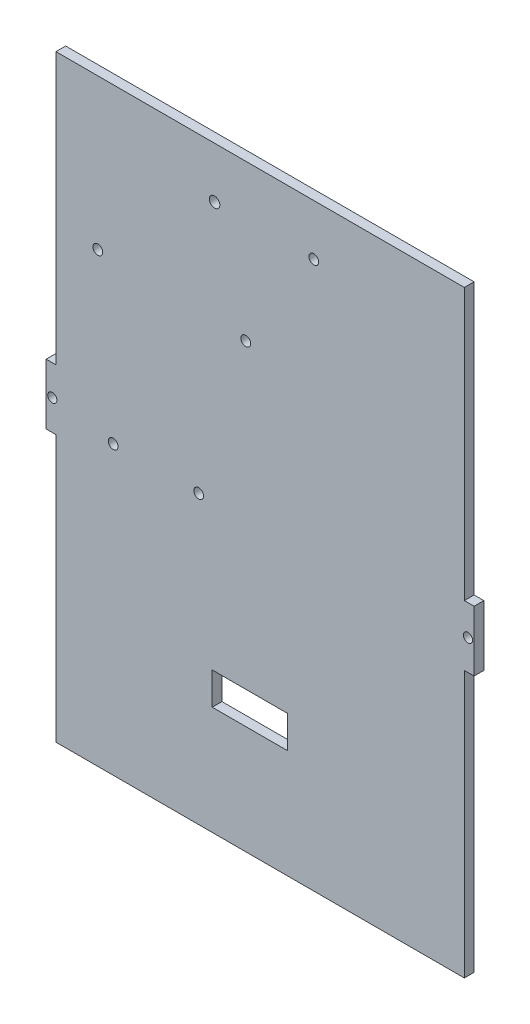
ISO-10303-21;
HEADER;
FILE_DESCRIPTION(('STEP AP214'),'2;1');
FILE_NAME('part.step','',(''),(''),'','','');
FILE_SCHEMA(('AUTOMOTIVE_DESIGN { 1 0 10303 214 1 1 1 1 }'));
ENDSEC;
DATA;
#1=APPLICATION_CONTEXT('core data for automotive mechanical design processes');
#2=APPLICATION_PROTOCOL_DEFINITION('international standard','automotive_design',2000,#1);
#3=PRODUCT_CONTEXT('',#1,'mechanical');
#4=PRODUCT('Part','Part','',(#3));
#5=PRODUCT_RELATED_PRODUCT_CATEGORY('part','',(#4));
#6=PRODUCT_DEFINITION_FORMATION('','',#4);
#7=PRODUCT_DEFINITION_CONTEXT('part definition',#1,'design');
#8=PRODUCT_DEFINITION('design','',#6,#7);
#9=PRODUCT_DEFINITION_SHAPE('','',#8);
#10=(LENGTH_UNIT() NAMED_UNIT(*) SI_UNIT(.MILLI.,.METRE.));
#11=(NAMED_UNIT(*) PLANE_ANGLE_UNIT() SI_UNIT($,.RADIAN.));
#12=(NAMED_UNIT(*) SI_UNIT($,.STERADIAN.) SOLID_ANGLE_UNIT());
#13=UNCERTAINTY_MEASURE_WITH_UNIT(LENGTH_MEASURE(1.E-05),#10,'distance_accuracy_value','');
#14=(GEOMETRIC_REPRESENTATION_CONTEXT(3) GLOBAL_UNCERTAINTY_ASSIGNED_CONTEXT((#13)) GLOBAL_UNIT_ASSIGNED_CONTEXT((#10,
#11,#12)) REPRESENTATION_CONTEXT('',''));
#15=CARTESIAN_POINT('',(0.,0.,0.));
#16=DIRECTION('',(0.,0.,1.));
#17=DIRECTION('',(1.,0.,0.));
#18=AXIS2_PLACEMENT_3D('',#15,#16,#17);
#19=CARTESIAN_POINT('',(69.85,100.01,3.18));
#20=DIRECTION('',(-1.,0.,0.));
#21=DIRECTION('',(0.,-1.,0.));
#22=AXIS2_PLACEMENT_3D('',#19,#20,#21);
#23=PLANE('',#22);
#24=DIRECTION('',(0.,1.,0.));
#25=VECTOR('',#24,1.);
#26=CARTESIAN_POINT('',(69.85,100.01,0.));
#27=LINE('',#26,#25);
#28=CARTESIAN_POINT('',(69.85,-9.875,0.));
#29=VERTEX_POINT('',#28);
#30=CARTESIAN_POINT('',(69.85,9.875,0.));
#31=VERTEX_POINT('',#30);
#32=EDGE_CURVE('E285',#29,#31,#27,.T.);
#33=ORIENTED_EDGE('',*,*,#32,.T.);
#34=DIRECTION('',(0.,0.,1.));
#35=VECTOR('',#34,1.);
#36=CARTESIAN_POINT('',(69.85,9.875,0.));
#37=LINE('',#36,#35);
#38=CARTESIAN_POINT('',(69.85,9.875,3.18));
#39=VERTEX_POINT('',#38);
#40=EDGE_CURVE('E308',#31,#39,#37,.T.);
#41=ORIENTED_EDGE('',*,*,#40,.T.);
#42=DIRECTION('',(0.,1.,0.));
#43=VECTOR('',#42,1.);
#44=CARTESIAN_POINT('',(69.85,100.01,3.18));
#45=LINE('',#44,#43);
#46=CARTESIAN_POINT('',(69.85,-9.875,3.18));
#47=VERTEX_POINT('',#46);
#48=EDGE_CURVE('E57',#47,#39,#45,.T.);
#49=ORIENTED_EDGE('',*,*,#48,.F.);
#50=DIRECTION('',(0.,0.,1.));
#51=VECTOR('',#50,1.);
#52=CARTESIAN_POINT('',(69.85,-9.875,0.));
#53=LINE('',#52,#51);
#54=EDGE_CURVE('E294',#29,#47,#53,.T.);
#55=ORIENTED_EDGE('',*,*,#54,.F.);
#56=EDGE_LOOP('',(#33,#41,#49,#55));
#57=FACE_BOUND('',#56,.T.);
#58=ADVANCED_FACE('F49',(#57),#23,.F.);
#59=CARTESIAN_POINT('',(-69.85,100.01,3.18));
#60=DIRECTION('',(1.,0.,0.));
#61=DIRECTION('',(0.,1.,0.));
#62=AXIS2_PLACEMENT_3D('',#59,#60,#61);
#63=PLANE('',#62);
#64=DIRECTION('',(0.,-1.,0.));
#65=VECTOR('',#64,1.);
#66=CARTESIAN_POINT('',(-69.85,100.01,3.18));
#67=LINE('',#66,#65);
#68=CARTESIAN_POINT('',(-69.85,9.875,3.18));
#69=VERTEX_POINT('',#68);
#70=CARTESIAN_POINT('',(-69.85,-9.875,3.18));
#71=VERTEX_POINT('',#70);
#72=EDGE_CURVE('E13',#69,#71,#67,.T.);
#73=ORIENTED_EDGE('',*,*,#72,.F.);
#74=DIRECTION('',(0.,0.,1.));
#75=VECTOR('',#74,1.);
#76=CARTESIAN_POINT('',(-69.85,9.875,0.));
#77=LINE('',#76,#75);
#78=CARTESIAN_POINT('',(-69.85,9.875,0.));
#79=VERTEX_POINT('',#78);
#80=EDGE_CURVE('E278',#79,#69,#77,.T.);
#81=ORIENTED_EDGE('',*,*,#80,.F.);
#82=DIRECTION('',(0.,-1.,0.));
#83=VECTOR('',#82,1.);
#84=CARTESIAN_POINT('',(-69.85,100.01,0.));
#85=LINE('',#84,#83);
#86=CARTESIAN_POINT('',(-69.85,-9.875,0.));
#87=VERTEX_POINT('',#86);
#88=EDGE_CURVE('E323',#79,#87,#85,.T.);
#89=ORIENTED_EDGE('',*,*,#88,.T.);
#90=DIRECTION('',(0.,0.,1.));
#91=VECTOR('',#90,1.);
#92=CARTESIAN_POINT('',(-69.85,-9.875,0.));
#93=LINE('',#92,#91);
#94=EDGE_CURVE('E259',#87,#71,#93,.T.);
#95=ORIENTED_EDGE('',*,*,#94,.T.);
#96=EDGE_LOOP('',(#73,#81,#89,#95));
#97=FACE_BOUND('',#96,.T.);
#98=ADVANCED_FACE('F346',(#97),#63,.F.);
#99=CARTESIAN_POINT('',(0.,0.,3.18));
#100=DIRECTION('',(0.,0.,1.));
#101=DIRECTION('',(1.,0.,0.));
#102=AXIS2_PLACEMENT_3D('',#99,#100,#101);
#103=PLANE('',#102);
#104=DIRECTION('',(-1.,0.,0.));
#105=VECTOR('',#104,1.);
#106=CARTESIAN_POINT('',(-66.67,-96.83,3.18));
#107=LINE('',#106,#105);
#108=CARTESIAN_POINT('',(66.67,-96.83,3.18));
#109=VERTEX_POINT('',#108);
#110=CARTESIAN_POINT('',(-66.67,-96.83,3.18));
#111=VERTEX_POINT('',#110);
#112=EDGE_CURVE('E241',#109,#111,#107,.T.);
#113=ORIENTED_EDGE('',*,*,#112,.F.);
#114=DIRECTION('',(0.,-1.,0.));
#115=VECTOR('',#114,1.);
#116=CARTESIAN_POINT('',(66.67,-100.01,3.18));
#117=LINE('',#116,#115);
#118=CARTESIAN_POINT('',(66.67,-9.87499999999999,3.18));
#119=VERTEX_POINT('',#118);
#120=EDGE_CURVE('E291',#119,#109,#117,.T.);
#121=ORIENTED_EDGE('',*,*,#120,.F.);
#122=DIRECTION('',(-1.,0.,0.));
#123=VECTOR('',#122,1.);
#124=CARTESIAN_POINT('',(69.85,-9.875,3.18));
#125=LINE('',#124,#123);
#126=EDGE_CURVE('E295',#47,#119,#125,.T.);
#127=ORIENTED_EDGE('',*,*,#126,.F.);
#128=ORIENTED_EDGE('',*,*,#48,.T.);
#129=DIRECTION('',(1.,0.,0.));
#130=VECTOR('',#129,1.);
#131=CARTESIAN_POINT('',(69.85,9.875,3.18));
#132=LINE('',#131,#130);
#133=CARTESIAN_POINT('',(66.67,9.875,3.18));
#134=VERTEX_POINT('',#133);
#135=EDGE_CURVE('E312',#134,#39,#132,.T.);
#136=ORIENTED_EDGE('',*,*,#135,.F.);
#137=DIRECTION('',(0.,-1.,0.));
#138=VECTOR('',#137,1.);
#139=CARTESIAN_POINT('',(66.67,100.01,3.18));
#140=LINE('',#139,#138);
#141=CARTESIAN_POINT('',(66.67,98.4200000000002,3.18));
#142=VERTEX_POINT('',#141);
#143=EDGE_CURVE('E245',#142,#134,#140,.T.);
#144=ORIENTED_EDGE('',*,*,#143,.F.);
#145=DIRECTION('',(1.,0.,0.));
#146=VECTOR('',#145,1.);
#147=CARTESIAN_POINT('',(66.67,98.4200000000002,3.18));
#148=LINE('',#147,#146);
#149=CARTESIAN_POINT('',(-66.67,98.4200000000002,3.18));
#150=VERTEX_POINT('',#149);
#151=EDGE_CURVE('E206',#150,#142,#148,.T.);
#152=ORIENTED_EDGE('',*,*,#151,.F.);
#153=DIRECTION('',(0.,1.,0.));
#154=VECTOR('',#153,1.);
#155=CARTESIAN_POINT('',(-66.67,100.01,3.18));
#156=LINE('',#155,#154);
#157=CARTESIAN_POINT('',(-66.67,9.875,3.18));
#158=VERTEX_POINT('',#157);
#159=EDGE_CURVE('E275',#158,#150,#156,.T.);
#160=ORIENTED_EDGE('',*,*,#159,.F.);
#161=DIRECTION('',(1.,0.,0.));
#162=VECTOR('',#161,1.);
#163=CARTESIAN_POINT('',(-69.85,9.875,3.18));
#164=LINE('',#163,#162);
#165=EDGE_CURVE('E262',#69,#158,#164,.T.);
#166=ORIENTED_EDGE('',*,*,#165,.F.);
#167=ORIENTED_EDGE('',*,*,#72,.T.);
#168=DIRECTION('',(-1.,0.,0.));
#169=VECTOR('',#168,1.);
#170=CARTESIAN_POINT('',(-69.85,-9.875,3.18));
#171=LINE('',#170,#169);
#172=CARTESIAN_POINT('',(-66.67,-9.87499999999999,3.18));
#173=VERTEX_POINT('',#172);
#174=EDGE_CURVE('E251',#173,#71,#171,.T.);
#175=ORIENTED_EDGE('',*,*,#174,.F.);
#176=DIRECTION('',(0.,1.,0.));
#177=VECTOR('',#176,1.);
#178=CARTESIAN_POINT('',(-66.67,-100.01,3.18));
#179=LINE('',#178,#177);
#180=EDGE_CURVE('E255',#111,#173,#179,.T.);
#181=ORIENTED_EDGE('',*,*,#180,.F.);
#182=EDGE_LOOP('',(#113,#121,#127,#128,#136,#144,#152,#160,#166,#167,#175,#181));
#183=FACE_BOUND('',#182,.T.);
#184=CARTESIAN_POINT('',(17.5238782385584,81.7973984042533,3.18));
#185=DIRECTION('',(0.,0.,1.));
#186=DIRECTION('',(1.,0.,0.));
#187=AXIS2_PLACEMENT_3D('',#184,#185,#186);
#188=CIRCLE('',#187,1.59000000000001);
#189=CARTESIAN_POINT('',(19.1138782385584,81.7973984042533,3.18));
#190=VERTEX_POINT('',#189);
#191=EDGE_CURVE('E330',#190,#190,#188,.T.);
#192=ORIENTED_EDGE('',*,*,#191,.F.);
#193=EDGE_LOOP('',(#192));
#194=FACE_BOUND('',#193,.T.);
#195=CARTESIAN_POINT('',(-14.8830919482617,81.7973984042533,3.18));
#196=DIRECTION('',(0.,0.,1.));
#197=DIRECTION('',(1.,0.,0.));
#198=AXIS2_PLACEMENT_3D('',#195,#196,#197);
#199=CIRCLE('',#198,1.71788268037511);
#200=CARTESIAN_POINT('',(-13.1652092678866,81.7973984042533,3.18));
#201=VERTEX_POINT('',#200);
#202=EDGE_CURVE('E187',#201,#201,#199,.T.);
#203=ORIENTED_EDGE('',*,*,#202,.F.);
#204=EDGE_LOOP('',(#203));
#205=FACE_BOUND('',#204,.T.);
#206=DIRECTION('',(0.,1.,0.));
#207=VECTOR('',#206,1.);
#208=CARTESIAN_POINT('',(8.92310875962821,-61.418139549545,3.18));
#209=LINE('',#208,#207);
#210=CARTESIAN_POINT('',(8.92310875962821,-61.418139549545,3.18));
#211=VERTEX_POINT('',#210);
#212=CARTESIAN_POINT('',(8.92310875962821,-50.8809258858847,3.18));
#213=VERTEX_POINT('',#212);
#214=EDGE_CURVE('E65',#211,#213,#209,.T.);
#215=ORIENTED_EDGE('',*,*,#214,.F.);
#216=DIRECTION('',(1.,0.,0.));
#217=VECTOR('',#216,1.);
#218=CARTESIAN_POINT('',(8.92310875962821,-61.418139549545,3.18));
#219=LINE('',#218,#217);
#220=CARTESIAN_POINT('',(-15.6426883360048,-61.418139549545,3.18));
#221=VERTEX_POINT('',#220);
#222=EDGE_CURVE('E181',#221,#211,#219,.T.);
#223=ORIENTED_EDGE('',*,*,#222,.F.);
#224=DIRECTION('',(0.,-1.,0.));
#225=VECTOR('',#224,1.);
#226=CARTESIAN_POINT('',(-15.6426883360048,-61.418139549545,3.18));
#227=LINE('',#226,#225);
#228=CARTESIAN_POINT('',(-15.6426883360048,-50.8809258858847,3.18));
#229=VERTEX_POINT('',#228);
#230=EDGE_CURVE('E184',#229,#221,#227,.T.);
#231=ORIENTED_EDGE('',*,*,#230,.F.);
#232=DIRECTION('',(-1.,0.,0.));
#233=VECTOR('',#232,1.);
#234=CARTESIAN_POINT('',(8.92310875962821,-50.8809258858847,3.18));
#235=LINE('',#234,#233);
#236=EDGE_CURVE('E193',#213,#229,#235,.T.);
#237=ORIENTED_EDGE('',*,*,#236,.F.);
#238=EDGE_LOOP('',(#215,#223,#231,#237));
#239=FACE_BOUND('',#238,.T.);
#240=CARTESIAN_POINT('',(-52.9812612776326,49.2928561322299,3.18));
#241=DIRECTION('',(0.,0.,1.));
#242=DIRECTION('',(1.,0.,0.));
#243=AXIS2_PLACEMENT_3D('',#240,#241,#242);
#244=CIRCLE('',#243,1.60000000000001);
#245=CARTESIAN_POINT('',(-51.3812612776326,49.2928561322299,3.18));
#246=VERTEX_POINT('',#245);
#247=EDGE_CURVE('E207',#246,#246,#244,.T.);
#248=ORIENTED_EDGE('',*,*,#247,.F.);
#249=EDGE_LOOP('',(#248));
#250=FACE_BOUND('',#249,.T.);
#251=CARTESIAN_POINT('',(-4.68387739000854,47.6157426562039,3.18));
#252=DIRECTION('',(0.,0.,1.));
#253=DIRECTION('',(1.,0.,0.));
#254=AXIS2_PLACEMENT_3D('',#251,#252,#253);
#255=CIRCLE('',#254,1.6);
#256=CARTESIAN_POINT('',(-3.08387739000854,47.6157426562039,3.18));
#257=VERTEX_POINT('',#256);
#258=EDGE_CURVE('E213',#257,#257,#255,.T.);
#259=ORIENTED_EDGE('',*,*,#258,.F.);
#260=EDGE_LOOP('',(#259));
#261=FACE_BOUND('',#260,.T.);
#262=CARTESIAN_POINT('',(-20.0649648908923,-3.15976470010088,3.18));
#263=DIRECTION('',(0.,0.,1.));
#264=DIRECTION('',(1.,0.,0.));
#265=AXIS2_PLACEMENT_3D('',#262,#263,#264);
#266=CIRCLE('',#265,1.6);
#267=CARTESIAN_POINT('',(-18.4649648908923,-3.15976470010088,3.18));
#268=VERTEX_POINT('',#267);
#269=EDGE_CURVE('E219',#268,#268,#266,.T.);
#270=ORIENTED_EDGE('',*,*,#269,.F.);
#271=EDGE_LOOP('',(#270));
#272=FACE_BOUND('',#271,.T.);
#273=CARTESIAN_POINT('',(-47.9649293307285,-3.1152197129914,3.18));
#274=DIRECTION('',(0.,0.,1.));
#275=DIRECTION('',(1.,0.,0.));
#276=AXIS2_PLACEMENT_3D('',#273,#274,#275);
#277=CIRCLE('',#276,1.6);
#278=CARTESIAN_POINT('',(-46.3649293307285,-3.1152197129914,3.18));
#279=VERTEX_POINT('',#278);
#280=EDGE_CURVE('E199',#279,#279,#277,.T.);
#281=ORIENTED_EDGE('',*,*,#280,.F.);
#282=EDGE_LOOP('',(#281));
#283=FACE_BOUND('',#282,.T.);
#284=CARTESIAN_POINT('',(67.85,0.,3.18));
#285=DIRECTION('',(0.,0.,1.));
#286=DIRECTION('',(-1.,0.,0.));
#287=AXIS2_PLACEMENT_3D('',#284,#285,#286);
#288=CIRCLE('',#287,1.5);
#289=CARTESIAN_POINT('',(66.35,0.,3.18));
#290=VERTEX_POINT('',#289);
#291=EDGE_CURVE('E305',#290,#290,#288,.T.);
#292=ORIENTED_EDGE('',*,*,#291,.F.);
#293=EDGE_LOOP('',(#292));
#294=FACE_BOUND('',#293,.T.);
#295=CARTESIAN_POINT('',(-67.85,0.,3.18));
#296=DIRECTION('',(0.,0.,1.));
#297=DIRECTION('',(1.,0.,0.));
#298=AXIS2_PLACEMENT_3D('',#295,#296,#297);
#299=CIRCLE('',#298,1.5);
#300=CARTESIAN_POINT('',(-66.35,0.,3.18));
#301=VERTEX_POINT('',#300);
#302=EDGE_CURVE('E267',#301,#301,#299,.T.);
#303=ORIENTED_EDGE('',*,*,#302,.F.);
#304=EDGE_LOOP('',(#303));
#305=FACE_BOUND('',#304,.T.);
#306=ADVANCED_FACE('F343',(#183,#194,#205,#239,#250,#261,#272,#283,#294,#305),#103,.T.);
#307=CARTESIAN_POINT('',(0.,0.,0.));
#308=DIRECTION('',(0.,0.,1.));
#309=DIRECTION('',(1.,0.,0.));
#310=AXIS2_PLACEMENT_3D('',#307,#308,#309);
#311=PLANE('',#310);
#312=CARTESIAN_POINT('',(17.5238782385584,81.7973984042533,0.));
#313=DIRECTION('',(0.,0.,1.));
#314=DIRECTION('',(1.,0.,0.));
#315=AXIS2_PLACEMENT_3D('',#312,#313,#314);
#316=CIRCLE('',#315,1.59000000000001);
#317=CARTESIAN_POINT('',(19.1138782385584,81.7973984042533,0.));
#318=VERTEX_POINT('',#317);
#319=EDGE_CURVE('E52',#318,#318,#316,.T.);
#320=ORIENTED_EDGE('',*,*,#319,.T.);
#321=EDGE_LOOP('',(#320));
#322=FACE_BOUND('',#321,.T.);
#323=CARTESIAN_POINT('',(-14.8830919482617,81.7973984042533,0.));
#324=DIRECTION('',(0.,0.,1.));
#325=DIRECTION('',(1.,0.,0.));
#326=AXIS2_PLACEMENT_3D('',#323,#324,#325);
#327=CIRCLE('',#326,1.71788268037511);
#328=CARTESIAN_POINT('',(-13.1652092678866,81.7973984042533,0.));
#329=VERTEX_POINT('',#328);
#330=EDGE_CURVE('E328',#329,#329,#327,.T.);
#331=ORIENTED_EDGE('',*,*,#330,.T.);
#332=EDGE_LOOP('',(#331));
#333=FACE_BOUND('',#332,.T.);
#334=DIRECTION('',(1.,0.,0.));
#335=VECTOR('',#334,1.);
#336=CARTESIAN_POINT('',(8.92310875962821,-61.418139549545,0.));
#337=LINE('',#336,#335);
#338=CARTESIAN_POINT('',(-15.6426883360048,-61.418139549545,0.));
#339=VERTEX_POINT('',#338);
#340=CARTESIAN_POINT('',(8.92310875962821,-61.418139549545,0.));
#341=VERTEX_POINT('',#340);
#342=EDGE_CURVE('E171',#339,#341,#337,.T.);
#343=ORIENTED_EDGE('',*,*,#342,.T.);
#344=DIRECTION('',(0.,1.,0.));
#345=VECTOR('',#344,1.);
#346=CARTESIAN_POINT('',(8.92310875962821,-61.418139549545,0.));
#347=LINE('',#346,#345);
#348=CARTESIAN_POINT('',(8.92310875962821,-50.8809258858847,0.));
#349=VERTEX_POINT('',#348);
#350=EDGE_CURVE('E165',#341,#349,#347,.T.);
#351=ORIENTED_EDGE('',*,*,#350,.T.);
#352=DIRECTION('',(-1.,0.,0.));
#353=VECTOR('',#352,1.);
#354=CARTESIAN_POINT('',(8.92310875962821,-50.8809258858847,0.));
#355=LINE('',#354,#353);
#356=CARTESIAN_POINT('',(-15.6426883360048,-50.8809258858847,0.));
#357=VERTEX_POINT('',#356);
#358=EDGE_CURVE('E174',#349,#357,#355,.T.);
#359=ORIENTED_EDGE('',*,*,#358,.T.);
#360=DIRECTION('',(0.,-1.,0.));
#361=VECTOR('',#360,1.);
#362=CARTESIAN_POINT('',(-15.6426883360048,-61.418139549545,0.));
#363=LINE('',#362,#361);
#364=EDGE_CURVE('E73',#357,#339,#363,.T.);
#365=ORIENTED_EDGE('',*,*,#364,.T.);
#366=EDGE_LOOP('',(#343,#351,#359,#365));
#367=FACE_BOUND('',#366,.T.);
#368=CARTESIAN_POINT('',(-52.9812612776326,49.2928561322299,0.));
#369=DIRECTION('',(0.,0.,1.));
#370=DIRECTION('',(1.,0.,0.));
#371=AXIS2_PLACEMENT_3D('',#368,#369,#370);
#372=CIRCLE('',#371,1.60000000000001);
#373=CARTESIAN_POINT('',(-51.3812612776326,49.2928561322299,0.));
#374=VERTEX_POINT('',#373);
#375=EDGE_CURVE('E203',#374,#374,#372,.T.);
#376=ORIENTED_EDGE('',*,*,#375,.T.);
#377=EDGE_LOOP('',(#376));
#378=FACE_BOUND('',#377,.T.);
#379=CARTESIAN_POINT('',(-4.68387739000854,47.6157426562039,0.));
#380=DIRECTION('',(0.,0.,1.));
#381=DIRECTION('',(1.,0.,0.));
#382=AXIS2_PLACEMENT_3D('',#379,#380,#381);
#383=CIRCLE('',#382,1.6);
#384=CARTESIAN_POINT('',(-3.08387739000854,47.6157426562039,0.));
#385=VERTEX_POINT('',#384);
#386=EDGE_CURVE('E210',#385,#385,#383,.T.);
#387=ORIENTED_EDGE('',*,*,#386,.T.);
#388=EDGE_LOOP('',(#387));
#389=FACE_BOUND('',#388,.T.);
#390=CARTESIAN_POINT('',(-20.0649648908923,-3.15976470010088,0.));
#391=DIRECTION('',(0.,0.,1.));
#392=DIRECTION('',(1.,0.,0.));
#393=AXIS2_PLACEMENT_3D('',#390,#391,#392);
#394=CIRCLE('',#393,1.6);
#395=CARTESIAN_POINT('',(-18.4649648908923,-3.15976470010088,0.));
#396=VERTEX_POINT('',#395);
#397=EDGE_CURVE('E216',#396,#396,#394,.T.);
#398=ORIENTED_EDGE('',*,*,#397,.T.);
#399=EDGE_LOOP('',(#398));
#400=FACE_BOUND('',#399,.T.);
#401=CARTESIAN_POINT('',(-47.9649293307285,-3.1152197129914,0.));
#402=DIRECTION('',(0.,0.,1.));
#403=DIRECTION('',(1.,0.,0.));
#404=AXIS2_PLACEMENT_3D('',#401,#402,#403);
#405=CIRCLE('',#404,1.6);
#406=CARTESIAN_POINT('',(-46.3649293307285,-3.1152197129914,0.));
#407=VERTEX_POINT('',#406);
#408=EDGE_CURVE('E222',#407,#407,#405,.T.);
#409=ORIENTED_EDGE('',*,*,#408,.T.);
#410=EDGE_LOOP('',(#409));
#411=FACE_BOUND('',#410,.T.);
#412=DIRECTION('',(0.,-1.,0.));
#413=VECTOR('',#412,1.);
#414=CARTESIAN_POINT('',(66.67,-100.01,0.));
#415=LINE('',#414,#413);
#416=CARTESIAN_POINT('',(66.67,-9.87499999999999,0.));
#417=VERTEX_POINT('',#416);
#418=CARTESIAN_POINT('',(66.67,-96.83,0.));
#419=VERTEX_POINT('',#418);
#420=EDGE_CURVE('E290',#417,#419,#415,.T.);
#421=ORIENTED_EDGE('',*,*,#420,.T.);
#422=DIRECTION('',(-1.,0.,0.));
#423=VECTOR('',#422,1.);
#424=CARTESIAN_POINT('',(-66.67,-96.83,0.));
#425=LINE('',#424,#423);
#426=CARTESIAN_POINT('',(-66.67,-96.83,0.));
#427=VERTEX_POINT('',#426);
#428=EDGE_CURVE('E237',#419,#427,#425,.T.);
#429=ORIENTED_EDGE('',*,*,#428,.T.);
#430=DIRECTION('',(0.,1.,0.));
#431=VECTOR('',#430,1.);
#432=CARTESIAN_POINT('',(-66.67,-100.01,0.));
#433=LINE('',#432,#431);
#434=CARTESIAN_POINT('',(-66.67,-9.87499999999999,0.));
#435=VERTEX_POINT('',#434);
#436=EDGE_CURVE('E248',#427,#435,#433,.T.);
#437=ORIENTED_EDGE('',*,*,#436,.T.);
#438=DIRECTION('',(-1.,0.,0.));
#439=VECTOR('',#438,1.);
#440=CARTESIAN_POINT('',(-69.85,-9.875,0.));
#441=LINE('',#440,#439);
#442=EDGE_CURVE('E250',#435,#87,#441,.T.);
#443=ORIENTED_EDGE('',*,*,#442,.T.);
#444=ORIENTED_EDGE('',*,*,#88,.F.);
#445=DIRECTION('',(1.,0.,0.));
#446=VECTOR('',#445,1.);
#447=CARTESIAN_POINT('',(-69.85,9.875,0.));
#448=LINE('',#447,#446);
#449=CARTESIAN_POINT('',(-66.67,9.875,0.));
#450=VERTEX_POINT('',#449);
#451=EDGE_CURVE('E271',#79,#450,#448,.T.);
#452=ORIENTED_EDGE('',*,*,#451,.T.);
#453=DIRECTION('',(0.,1.,0.));
#454=VECTOR('',#453,1.);
#455=CARTESIAN_POINT('',(-66.67,100.01,0.));
#456=LINE('',#455,#454);
#457=CARTESIAN_POINT('',(-66.67,98.4200000000002,0.));
#458=VERTEX_POINT('',#457);
#459=EDGE_CURVE('E274',#450,#458,#456,.T.);
#460=ORIENTED_EDGE('',*,*,#459,.T.);
#461=DIRECTION('',(1.,0.,0.));
#462=VECTOR('',#461,1.);
#463=CARTESIAN_POINT('',(66.67,98.4200000000002,0.));
#464=LINE('',#463,#462);
#465=CARTESIAN_POINT('',(66.67,98.4200000000002,0.));
#466=VERTEX_POINT('',#465);
#467=EDGE_CURVE('E227',#458,#466,#464,.T.);
#468=ORIENTED_EDGE('',*,*,#467,.T.);
#469=DIRECTION('',(0.,-1.,0.));
#470=VECTOR('',#469,1.);
#471=CARTESIAN_POINT('',(66.67,100.01,0.));
#472=LINE('',#471,#470);
#473=CARTESIAN_POINT('',(66.67,9.875,0.));
#474=VERTEX_POINT('',#473);
#475=EDGE_CURVE('E309',#466,#474,#472,.T.);
#476=ORIENTED_EDGE('',*,*,#475,.T.);
#477=DIRECTION('',(1.,0.,0.));
#478=VECTOR('',#477,1.);
#479=CARTESIAN_POINT('',(69.85,9.875,0.));
#480=LINE('',#479,#478);
#481=EDGE_CURVE('E311',#474,#31,#480,.T.);
#482=ORIENTED_EDGE('',*,*,#481,.T.);
#483=ORIENTED_EDGE('',*,*,#32,.F.);
#484=DIRECTION('',(-1.,0.,0.));
#485=VECTOR('',#484,1.);
#486=CARTESIAN_POINT('',(69.85,-9.875,0.));
#487=LINE('',#486,#485);
#488=EDGE_CURVE('E287',#29,#417,#487,.T.);
#489=ORIENTED_EDGE('',*,*,#488,.T.);
#490=EDGE_LOOP('',(#421,#429,#437,#443,#444,#452,#460,#468,#476,#482,#483,#489));
#491=FACE_BOUND('',#490,.T.);
#492=CARTESIAN_POINT('',(67.85,0.,0.));
#493=DIRECTION('',(0.,0.,1.));
#494=DIRECTION('',(-1.,0.,0.));
#495=AXIS2_PLACEMENT_3D('',#492,#493,#494);
#496=CIRCLE('',#495,1.5);
#497=CARTESIAN_POINT('',(66.35,0.,0.));
#498=VERTEX_POINT('',#497);
#499=EDGE_CURVE('E298',#498,#498,#496,.T.);
#500=ORIENTED_EDGE('',*,*,#499,.T.);
#501=EDGE_LOOP('',(#500));
#502=FACE_BOUND('',#501,.T.);
#503=CARTESIAN_POINT('',(-67.85,0.,0.));
#504=DIRECTION('',(0.,0.,1.));
#505=DIRECTION('',(1.,0.,0.));
#506=AXIS2_PLACEMENT_3D('',#503,#504,#505);
#507=CIRCLE('',#506,1.5);
#508=CARTESIAN_POINT('',(-66.35,0.,0.));
#509=VERTEX_POINT('',#508);
#510=EDGE_CURVE('E257',#509,#509,#507,.T.);
#511=ORIENTED_EDGE('',*,*,#510,.T.);
#512=EDGE_LOOP('',(#511));
#513=FACE_BOUND('',#512,.T.);
#514=ADVANCED_FACE('F178',(#322,#333,#367,#378,#389,#400,#411,#491,#502,#513),#311,.F.);
#515=CARTESIAN_POINT('',(-67.85,0.,0.));
#516=DIRECTION('',(0.,0.,1.));
#517=DIRECTION('',(1.,0.,0.));
#518=AXIS2_PLACEMENT_3D('',#515,#516,#517);
#519=CYLINDRICAL_SURFACE('',#518,1.5);
#520=ORIENTED_EDGE('',*,*,#510,.F.);
#521=EDGE_LOOP('',(#520));
#522=FACE_BOUND('',#521,.T.);
#523=ORIENTED_EDGE('',*,*,#302,.T.);
#524=EDGE_LOOP('',(#523));
#525=FACE_BOUND('',#524,.T.);
#526=ADVANCED_FACE('F363',(#522,#525),#519,.F.);
#527=CARTESIAN_POINT('',(-69.85,-9.875,0.));
#528=DIRECTION('',(0.,1.,0.));
#529=DIRECTION('',(-1.,0.,0.));
#530=AXIS2_PLACEMENT_3D('',#527,#528,#529);
#531=PLANE('',#530);
#532=ORIENTED_EDGE('',*,*,#174,.T.);
#533=ORIENTED_EDGE('',*,*,#94,.F.);
#534=ORIENTED_EDGE('',*,*,#442,.F.);
#535=DIRECTION('',(0.,0.,1.));
#536=VECTOR('',#535,1.);
#537=CARTESIAN_POINT('',(-66.67,-9.87499999999999,0.));
#538=LINE('',#537,#536);
#539=EDGE_CURVE('E254',#435,#173,#538,.T.);
#540=ORIENTED_EDGE('',*,*,#539,.T.);
#541=EDGE_LOOP('',(#532,#533,#534,#540));
#542=FACE_BOUND('',#541,.T.);
#543=ADVANCED_FACE('F365',(#542),#531,.F.);
#544=CARTESIAN_POINT('',(-66.67,-100.01,0.));
#545=DIRECTION('',(1.,0.,0.));
#546=DIRECTION('',(0.,1.,0.));
#547=AXIS2_PLACEMENT_3D('',#544,#545,#546);
#548=PLANE('',#547);
#549=ORIENTED_EDGE('',*,*,#436,.F.);
#550=DIRECTION('',(0.,0.,1.));
#551=VECTOR('',#550,1.);
#552=CARTESIAN_POINT('',(-66.67,-96.83,0.));
#553=LINE('',#552,#551);
#554=EDGE_CURVE('E240',#427,#111,#553,.T.);
#555=ORIENTED_EDGE('',*,*,#554,.T.);
#556=ORIENTED_EDGE('',*,*,#180,.T.);
#557=ORIENTED_EDGE('',*,*,#539,.F.);
#558=EDGE_LOOP('',(#549,#555,#556,#557));
#559=FACE_BOUND('',#558,.T.);
#560=ADVANCED_FACE('F372',(#559),#548,.F.);
#561=CARTESIAN_POINT('',(-66.67,100.01,0.));
#562=DIRECTION('',(1.,0.,0.));
#563=DIRECTION('',(0.,1.,0.));
#564=AXIS2_PLACEMENT_3D('',#561,#562,#563);
#565=PLANE('',#564);
#566=ORIENTED_EDGE('',*,*,#159,.T.);
#567=DIRECTION('',(0.,0.,1.));
#568=VECTOR('',#567,1.);
#569=CARTESIAN_POINT('',(-66.67,98.4200000000002,0.));
#570=LINE('',#569,#568);
#571=EDGE_CURVE('E230',#458,#150,#570,.T.);
#572=ORIENTED_EDGE('',*,*,#571,.F.);
#573=ORIENTED_EDGE('',*,*,#459,.F.);
#574=DIRECTION('',(0.,0.,1.));
#575=VECTOR('',#574,1.);
#576=CARTESIAN_POINT('',(-66.67,9.875,0.));
#577=LINE('',#576,#575);
#578=EDGE_CURVE('E283',#450,#158,#577,.T.);
#579=ORIENTED_EDGE('',*,*,#578,.T.);
#580=EDGE_LOOP('',(#566,#572,#573,#579));
#581=FACE_BOUND('',#580,.T.);
#582=ADVANCED_FACE('F426',(#581),#565,.F.);
#583=CARTESIAN_POINT('',(-69.85,9.875,0.));
#584=DIRECTION('',(0.,-1.,0.));
#585=DIRECTION('',(1.,0.,0.));
#586=AXIS2_PLACEMENT_3D('',#583,#584,#585);
#587=PLANE('',#586);
#588=ORIENTED_EDGE('',*,*,#165,.T.);
#589=ORIENTED_EDGE('',*,*,#578,.F.);
#590=ORIENTED_EDGE('',*,*,#451,.F.);
#591=ORIENTED_EDGE('',*,*,#80,.T.);
#592=EDGE_LOOP('',(#588,#589,#590,#591));
#593=FACE_BOUND('',#592,.T.);
#594=ADVANCED_FACE('F424',(#593),#587,.F.);
#595=CARTESIAN_POINT('',(66.67,-100.01,0.));
#596=DIRECTION('',(-1.,0.,0.));
#597=DIRECTION('',(0.,-1.,0.));
#598=AXIS2_PLACEMENT_3D('',#595,#596,#597);
#599=PLANE('',#598);
#600=ORIENTED_EDGE('',*,*,#120,.T.);
#601=DIRECTION('',(0.,0.,1.));
#602=VECTOR('',#601,1.);
#603=CARTESIAN_POINT('',(66.67,-96.83,0.));
#604=LINE('',#603,#602);
#605=EDGE_CURVE('E235',#419,#109,#604,.T.);
#606=ORIENTED_EDGE('',*,*,#605,.F.);
#607=ORIENTED_EDGE('',*,*,#420,.F.);
#608=DIRECTION('',(0.,0.,1.));
#609=VECTOR('',#608,1.);
#610=CARTESIAN_POINT('',(66.67,-9.87499999999999,0.));
#611=LINE('',#610,#609);
#612=EDGE_CURVE('E270',#417,#119,#611,.T.);
#613=ORIENTED_EDGE('',*,*,#612,.T.);
#614=EDGE_LOOP('',(#600,#606,#607,#613));
#615=FACE_BOUND('',#614,.T.);
#616=ADVANCED_FACE('F409',(#615),#599,.F.);
#617=CARTESIAN_POINT('',(69.85,-9.875,0.));
#618=DIRECTION('',(0.,1.,0.));
#619=DIRECTION('',(-1.,0.,0.));
#620=AXIS2_PLACEMENT_3D('',#617,#618,#619);
#621=PLANE('',#620);
#622=ORIENTED_EDGE('',*,*,#126,.T.);
#623=ORIENTED_EDGE('',*,*,#612,.F.);
#624=ORIENTED_EDGE('',*,*,#488,.F.);
#625=ORIENTED_EDGE('',*,*,#54,.T.);
#626=EDGE_LOOP('',(#622,#623,#624,#625));
#627=FACE_BOUND('',#626,.T.);
#628=ADVANCED_FACE('F407',(#627),#621,.F.);
#629=CARTESIAN_POINT('',(67.85,0.,0.));
#630=DIRECTION('',(0.,0.,1.));
#631=DIRECTION('',(1.,0.,0.));
#632=AXIS2_PLACEMENT_3D('',#629,#630,#631);
#633=CYLINDRICAL_SURFACE('',#632,1.5);
#634=ORIENTED_EDGE('',*,*,#499,.F.);
#635=EDGE_LOOP('',(#634));
#636=FACE_BOUND('',#635,.T.);
#637=ORIENTED_EDGE('',*,*,#291,.T.);
#638=EDGE_LOOP('',(#637));
#639=FACE_BOUND('',#638,.T.);
#640=ADVANCED_FACE('F456',(#636,#639),#633,.F.);
#641=CARTESIAN_POINT('',(69.85,9.875,0.));
#642=DIRECTION('',(0.,-1.,0.));
#643=DIRECTION('',(1.,0.,0.));
#644=AXIS2_PLACEMENT_3D('',#641,#642,#643);
#645=PLANE('',#644);
#646=ORIENTED_EDGE('',*,*,#135,.T.);
#647=ORIENTED_EDGE('',*,*,#40,.F.);
#648=ORIENTED_EDGE('',*,*,#481,.F.);
#649=DIRECTION('',(0.,0.,1.));
#650=VECTOR('',#649,1.);
#651=CARTESIAN_POINT('',(66.67,9.875,0.));
#652=LINE('',#651,#650);
#653=EDGE_CURVE('E315',#474,#134,#652,.T.);
#654=ORIENTED_EDGE('',*,*,#653,.T.);
#655=EDGE_LOOP('',(#646,#647,#648,#654));
#656=FACE_BOUND('',#655,.T.);
#657=ADVANCED_FACE('F395',(#656),#645,.F.);
#658=CARTESIAN_POINT('',(66.67,100.01,0.));
#659=DIRECTION('',(-1.,0.,0.));
#660=DIRECTION('',(0.,-1.,0.));
#661=AXIS2_PLACEMENT_3D('',#658,#659,#660);
#662=PLANE('',#661);
#663=ORIENTED_EDGE('',*,*,#475,.F.);
#664=DIRECTION('',(0.,0.,1.));
#665=VECTOR('',#664,1.);
#666=CARTESIAN_POINT('',(66.67,98.4200000000002,0.));
#667=LINE('',#666,#665);
#668=EDGE_CURVE('E232',#466,#142,#667,.T.);
#669=ORIENTED_EDGE('',*,*,#668,.T.);
#670=ORIENTED_EDGE('',*,*,#143,.T.);
#671=ORIENTED_EDGE('',*,*,#653,.F.);
#672=EDGE_LOOP('',(#663,#669,#670,#671));
#673=FACE_BOUND('',#672,.T.);
#674=ADVANCED_FACE('F398',(#673),#662,.F.);
#675=CARTESIAN_POINT('',(-66.67,-96.83,0.));
#676=DIRECTION('',(0.,1.,0.));
#677=DIRECTION('',(0.,0.,1.));
#678=AXIS2_PLACEMENT_3D('',#675,#676,#677);
#679=PLANE('',#678);
#680=ORIENTED_EDGE('',*,*,#112,.T.);
#681=ORIENTED_EDGE('',*,*,#554,.F.);
#682=ORIENTED_EDGE('',*,*,#428,.F.);
#683=ORIENTED_EDGE('',*,*,#605,.T.);
#684=EDGE_LOOP('',(#680,#681,#682,#683));
#685=FACE_BOUND('',#684,.T.);
#686=ADVANCED_FACE('F432',(#685),#679,.F.);
#687=CARTESIAN_POINT('',(66.67,98.4200000000002,0.));
#688=DIRECTION('',(0.,-1.,0.));
#689=DIRECTION('',(0.,0.,-1.));
#690=AXIS2_PLACEMENT_3D('',#687,#688,#689);
#691=PLANE('',#690);
#692=ORIENTED_EDGE('',*,*,#151,.T.);
#693=ORIENTED_EDGE('',*,*,#668,.F.);
#694=ORIENTED_EDGE('',*,*,#467,.F.);
#695=ORIENTED_EDGE('',*,*,#571,.T.);
#696=EDGE_LOOP('',(#692,#693,#694,#695));
#697=FACE_BOUND('',#696,.T.);
#698=ADVANCED_FACE('F429',(#697),#691,.F.);
#699=CARTESIAN_POINT('',(-47.9649293307285,-3.1152197129914,0.));
#700=DIRECTION('',(0.,0.,1.));
#701=DIRECTION('',(1.,0.,0.));
#702=AXIS2_PLACEMENT_3D('',#699,#700,#701);
#703=CYLINDRICAL_SURFACE('',#702,1.6);
#704=ORIENTED_EDGE('',*,*,#408,.F.);
#705=EDGE_LOOP('',(#704));
#706=FACE_BOUND('',#705,.T.);
#707=ORIENTED_EDGE('',*,*,#280,.T.);
#708=EDGE_LOOP('',(#707));
#709=FACE_BOUND('',#708,.T.);
#710=ADVANCED_FACE('F431',(#706,#709),#703,.F.);
#711=CARTESIAN_POINT('',(-20.0649648908923,-3.15976470010088,0.));
#712=DIRECTION('',(0.,0.,1.));
#713=DIRECTION('',(1.,0.,0.));
#714=AXIS2_PLACEMENT_3D('',#711,#712,#713);
#715=CYLINDRICAL_SURFACE('',#714,1.6);
#716=ORIENTED_EDGE('',*,*,#397,.F.);
#717=EDGE_LOOP('',(#716));
#718=FACE_BOUND('',#717,.T.);
#719=ORIENTED_EDGE('',*,*,#269,.T.);
#720=EDGE_LOOP('',(#719));
#721=FACE_BOUND('',#720,.T.);
#722=ADVANCED_FACE('F438',(#718,#721),#715,.F.);
#723=CARTESIAN_POINT('',(-4.68387739000854,47.6157426562039,0.));
#724=DIRECTION('',(0.,0.,1.));
#725=DIRECTION('',(1.,0.,0.));
#726=AXIS2_PLACEMENT_3D('',#723,#724,#725);
#727=CYLINDRICAL_SURFACE('',#726,1.6);
#728=ORIENTED_EDGE('',*,*,#386,.F.);
#729=EDGE_LOOP('',(#728));
#730=FACE_BOUND('',#729,.T.);
#731=ORIENTED_EDGE('',*,*,#258,.T.);
#732=EDGE_LOOP('',(#731));
#733=FACE_BOUND('',#732,.T.);
#734=ADVANCED_FACE('F549',(#730,#733),#727,.F.);
#735=CARTESIAN_POINT('',(-52.9812612776326,49.2928561322299,0.));
#736=DIRECTION('',(0.,0.,1.));
#737=DIRECTION('',(1.,0.,0.));
#738=AXIS2_PLACEMENT_3D('',#735,#736,#737);
#739=CYLINDRICAL_SURFACE('',#738,1.60000000000001);
#740=ORIENTED_EDGE('',*,*,#375,.F.);
#741=EDGE_LOOP('',(#740));
#742=FACE_BOUND('',#741,.T.);
#743=ORIENTED_EDGE('',*,*,#247,.T.);
#744=EDGE_LOOP('',(#743));
#745=FACE_BOUND('',#744,.T.);
#746=ADVANCED_FACE('F540',(#742,#745),#739,.F.);
#747=CARTESIAN_POINT('',(8.92310875962821,-61.418139549545,0.));
#748=DIRECTION('',(1.,0.,0.));
#749=DIRECTION('',(0.,0.,-1.));
#750=AXIS2_PLACEMENT_3D('',#747,#748,#749);
#751=PLANE('',#750);
#752=ORIENTED_EDGE('',*,*,#214,.T.);
#753=DIRECTION('',(0.,0.,1.));
#754=VECTOR('',#753,1.);
#755=CARTESIAN_POINT('',(8.92310875962821,-50.8809258858847,0.));
#756=LINE('',#755,#754);
#757=EDGE_CURVE('E161',#349,#213,#756,.T.);
#758=ORIENTED_EDGE('',*,*,#757,.F.);
#759=ORIENTED_EDGE('',*,*,#350,.F.);
#760=DIRECTION('',(0.,0.,1.));
#761=VECTOR('',#760,1.);
#762=CARTESIAN_POINT('',(8.92310875962821,-61.418139549545,0.));
#763=LINE('',#762,#761);
#764=EDGE_CURVE('E197',#341,#211,#763,.T.);
#765=ORIENTED_EDGE('',*,*,#764,.T.);
#766=EDGE_LOOP('',(#752,#758,#759,#765));
#767=FACE_BOUND('',#766,.T.);
#768=ADVANCED_FACE('F163',(#767),#751,.F.);
#769=CARTESIAN_POINT('',(8.92310875962821,-61.418139549545,0.));
#770=DIRECTION('',(0.,-1.,0.));
#771=DIRECTION('',(0.,0.,-1.));
#772=AXIS2_PLACEMENT_3D('',#769,#770,#771);
#773=PLANE('',#772);
#774=ORIENTED_EDGE('',*,*,#222,.T.);
#775=ORIENTED_EDGE('',*,*,#764,.F.);
#776=ORIENTED_EDGE('',*,*,#342,.F.);
#777=DIRECTION('',(0.,0.,1.));
#778=VECTOR('',#777,1.);
#779=CARTESIAN_POINT('',(-15.6426883360048,-61.418139549545,0.));
#780=LINE('',#779,#778);
#781=EDGE_CURVE('E200',#339,#221,#780,.T.);
#782=ORIENTED_EDGE('',*,*,#781,.T.);
#783=EDGE_LOOP('',(#774,#775,#776,#782));
#784=FACE_BOUND('',#783,.T.);
#785=ADVANCED_FACE('F522',(#784),#773,.F.);
#786=CARTESIAN_POINT('',(-15.6426883360048,-61.418139549545,0.));
#787=DIRECTION('',(-1.,0.,0.));
#788=DIRECTION('',(0.,0.,1.));
#789=AXIS2_PLACEMENT_3D('',#786,#787,#788);
#790=PLANE('',#789);
#791=ORIENTED_EDGE('',*,*,#230,.T.);
#792=ORIENTED_EDGE('',*,*,#781,.F.);
#793=ORIENTED_EDGE('',*,*,#364,.F.);
#794=DIRECTION('',(0.,0.,1.));
#795=VECTOR('',#794,1.);
#796=CARTESIAN_POINT('',(-15.6426883360048,-50.8809258858847,0.));
#797=LINE('',#796,#795);
#798=EDGE_CURVE('E170',#357,#229,#797,.T.);
#799=ORIENTED_EDGE('',*,*,#798,.T.);
#800=EDGE_LOOP('',(#791,#792,#793,#799));
#801=FACE_BOUND('',#800,.T.);
#802=ADVANCED_FACE('F513',(#801),#790,.F.);
#803=CARTESIAN_POINT('',(8.92310875962821,-50.8809258858847,0.));
#804=DIRECTION('',(0.,1.,0.));
#805=DIRECTION('',(0.,0.,1.));
#806=AXIS2_PLACEMENT_3D('',#803,#804,#805);
#807=PLANE('',#806);
#808=ORIENTED_EDGE('',*,*,#236,.T.);
#809=ORIENTED_EDGE('',*,*,#798,.F.);
#810=ORIENTED_EDGE('',*,*,#358,.F.);
#811=ORIENTED_EDGE('',*,*,#757,.T.);
#812=EDGE_LOOP('',(#808,#809,#810,#811));
#813=FACE_BOUND('',#812,.T.);
#814=ADVANCED_FACE('F175',(#813),#807,.F.);
#815=CARTESIAN_POINT('',(-14.8830919482617,81.7973984042533,-31.82));
#816=DIRECTION('',(0.,0.,1.));
#817=DIRECTION('',(1.,0.,0.));
#818=AXIS2_PLACEMENT_3D('',#815,#816,#817);
#819=CYLINDRICAL_SURFACE('',#818,1.71788268037511);
#820=ORIENTED_EDGE('',*,*,#202,.T.);
#821=EDGE_LOOP('',(#820));
#822=FACE_BOUND('',#821,.T.);
#823=ORIENTED_EDGE('',*,*,#330,.F.);
#824=EDGE_LOOP('',(#823));
#825=FACE_BOUND('',#824,.T.);
#826=ADVANCED_FACE('F340',(#822,#825),#819,.F.);
#827=CARTESIAN_POINT('',(17.5238782385584,81.7973984042533,-31.82));
#828=DIRECTION('',(0.,0.,1.));
#829=DIRECTION('',(1.,0.,0.));
#830=AXIS2_PLACEMENT_3D('',#827,#828,#829);
#831=CYLINDRICAL_SURFACE('',#830,1.59000000000001);
#832=ORIENTED_EDGE('',*,*,#191,.T.);
#833=EDGE_LOOP('',(#832));
#834=FACE_BOUND('',#833,.T.);
#835=ORIENTED_EDGE('',*,*,#319,.F.);
#836=EDGE_LOOP('',(#835));
#837=FACE_BOUND('',#836,.T.);
#838=ADVANCED_FACE('F492',(#834,#837),#831,.F.);
#839=CLOSED_SHELL('',(#58,#98,#306,#514,#526,#543,#560,#582,#594,#616,#628,#640,#657,#674,#686,
#698,#710,#722,#734,#746,#768,#785,#802,#814,#826,#838));
#840=MANIFOLD_SOLID_BREP('B2',#839);
#841=ADVANCED_BREP_SHAPE_REPRESENTATION('',(#18,#840),#14);
#842=SHAPE_DEFINITION_REPRESENTATION(#9,#841);
ENDSEC;
END-ISO-10303-21;
